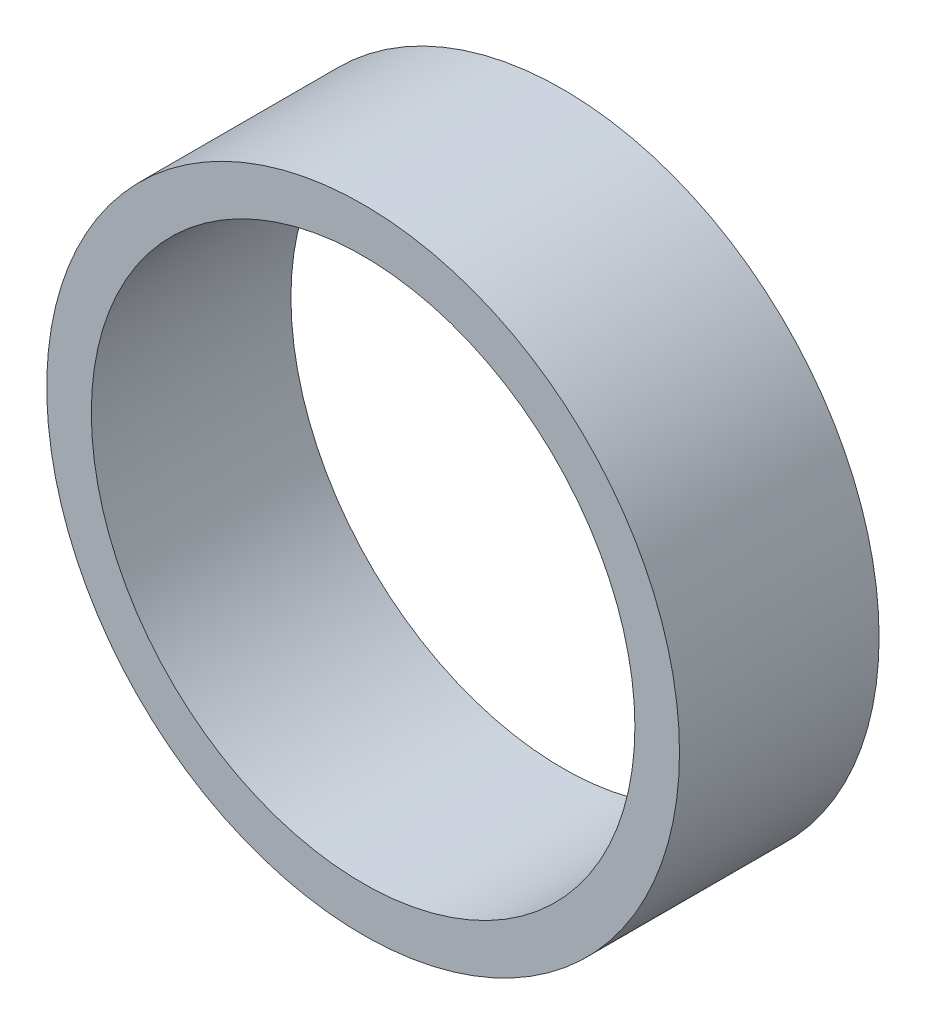
ISO-10303-21;
HEADER;
FILE_DESCRIPTION(('STEP AP214'),'2;1');
FILE_NAME('part.step','',(''),(''),'','','');
FILE_SCHEMA(('AUTOMOTIVE_DESIGN { 1 0 10303 214 1 1 1 1 }'));
ENDSEC;
DATA;
#1=APPLICATION_CONTEXT('core data for automotive mechanical design processes');
#2=APPLICATION_PROTOCOL_DEFINITION('international standard','automotive_design',2000,#1);
#3=PRODUCT_CONTEXT('',#1,'mechanical');
#4=PRODUCT('Part','Part','',(#3));
#5=PRODUCT_RELATED_PRODUCT_CATEGORY('part','',(#4));
#6=PRODUCT_DEFINITION_FORMATION('','',#4);
#7=PRODUCT_DEFINITION_CONTEXT('part definition',#1,'design');
#8=PRODUCT_DEFINITION('design','',#6,#7);
#9=PRODUCT_DEFINITION_SHAPE('','',#8);
#10=(LENGTH_UNIT() NAMED_UNIT(*) SI_UNIT(.MILLI.,.METRE.));
#11=(NAMED_UNIT(*) PLANE_ANGLE_UNIT() SI_UNIT($,.RADIAN.));
#12=(NAMED_UNIT(*) SI_UNIT($,.STERADIAN.) SOLID_ANGLE_UNIT());
#13=UNCERTAINTY_MEASURE_WITH_UNIT(LENGTH_MEASURE(1.E-05),#10,'distance_accuracy_value','');
#14=(GEOMETRIC_REPRESENTATION_CONTEXT(3) GLOBAL_UNCERTAINTY_ASSIGNED_CONTEXT((#13)) GLOBAL_UNIT_ASSIGNED_CONTEXT((#10,
#11,#12)) REPRESENTATION_CONTEXT('',''));
#15=CARTESIAN_POINT('',(0.,0.,0.));
#16=DIRECTION('',(0.,0.,1.));
#17=DIRECTION('',(1.,0.,0.));
#18=AXIS2_PLACEMENT_3D('',#15,#16,#17);
#19=CARTESIAN_POINT('',(0.,0.,4.7));
#20=DIRECTION('',(0.,0.,1.));
#21=DIRECTION('',(1.,0.,0.));
#22=AXIS2_PLACEMENT_3D('',#19,#20,#21);
#23=PLANE('',#22);
#24=CARTESIAN_POINT('',(0.,0.,4.7));
#25=DIRECTION('',(0.,0.,1.));
#26=DIRECTION('',(1.,0.,0.));
#27=AXIS2_PLACEMENT_3D('',#24,#25,#26);
#28=CIRCLE('',#27,7.45);
#29=CARTESIAN_POINT('',(7.45,0.,4.7));
#30=VERTEX_POINT('',#29);
#31=EDGE_CURVE('E10',#30,#30,#28,.T.);
#32=ORIENTED_EDGE('',*,*,#31,.T.);
#33=EDGE_LOOP('',(#32));
#34=FACE_BOUND('',#33,.T.);
#35=CARTESIAN_POINT('',(0.,0.,4.7));
#36=DIRECTION('',(0.,0.,1.));
#37=DIRECTION('',(1.,0.,0.));
#38=AXIS2_PLACEMENT_3D('',#35,#36,#37);
#39=CIRCLE('',#38,6.4);
#40=CARTESIAN_POINT('',(6.4,0.,4.7));
#41=VERTEX_POINT('',#40);
#42=EDGE_CURVE('E46',#41,#41,#39,.T.);
#43=ORIENTED_EDGE('',*,*,#42,.F.);
#44=EDGE_LOOP('',(#43));
#45=FACE_BOUND('',#44,.T.);
#46=ADVANCED_FACE('F35',(#34,#45),#23,.T.);
#47=CARTESIAN_POINT('',(0.,0.,0.));
#48=DIRECTION('',(0.,0.,1.));
#49=DIRECTION('',(1.,0.,0.));
#50=AXIS2_PLACEMENT_3D('',#47,#48,#49);
#51=PLANE('',#50);
#52=CARTESIAN_POINT('',(0.,0.,0.));
#53=DIRECTION('',(0.,0.,1.));
#54=DIRECTION('',(1.,0.,0.));
#55=AXIS2_PLACEMENT_3D('',#52,#53,#54);
#56=CIRCLE('',#55,7.45);
#57=CARTESIAN_POINT('',(7.45,0.,0.));
#58=VERTEX_POINT('',#57);
#59=EDGE_CURVE('E39',#58,#58,#56,.T.);
#60=ORIENTED_EDGE('',*,*,#59,.F.);
#61=EDGE_LOOP('',(#60));
#62=FACE_BOUND('',#61,.T.);
#63=CARTESIAN_POINT('',(0.,0.,0.));
#64=DIRECTION('',(0.,0.,1.));
#65=DIRECTION('',(1.,0.,0.));
#66=AXIS2_PLACEMENT_3D('',#63,#64,#65);
#67=CIRCLE('',#66,6.4);
#68=CARTESIAN_POINT('',(6.4,0.,0.));
#69=VERTEX_POINT('',#68);
#70=EDGE_CURVE('E48',#69,#69,#67,.T.);
#71=ORIENTED_EDGE('',*,*,#70,.T.);
#72=EDGE_LOOP('',(#71));
#73=FACE_BOUND('',#72,.T.);
#74=ADVANCED_FACE('F58',(#62,#73),#51,.F.);
#75=CARTESIAN_POINT('',(0.,0.,4.7));
#76=DIRECTION('',(0.,0.,-1.));
#77=DIRECTION('',(-1.,0.,0.));
#78=AXIS2_PLACEMENT_3D('',#75,#76,#77);
#79=CYLINDRICAL_SURFACE('',#78,7.45);
#80=ORIENTED_EDGE('',*,*,#31,.F.);
#81=EDGE_LOOP('',(#80));
#82=FACE_BOUND('',#81,.T.);
#83=ORIENTED_EDGE('',*,*,#59,.T.);
#84=EDGE_LOOP('',(#83));
#85=FACE_BOUND('',#84,.T.);
#86=ADVANCED_FACE('F37',(#82,#85),#79,.T.);
#87=CARTESIAN_POINT('',(0.,0.,4.7));
#88=DIRECTION('',(0.,0.,-1.));
#89=DIRECTION('',(-1.,0.,0.));
#90=AXIS2_PLACEMENT_3D('',#87,#88,#89);
#91=CYLINDRICAL_SURFACE('',#90,6.4);
#92=ORIENTED_EDGE('',*,*,#42,.T.);
#93=EDGE_LOOP('',(#92));
#94=FACE_BOUND('',#93,.T.);
#95=ORIENTED_EDGE('',*,*,#70,.F.);
#96=EDGE_LOOP('',(#95));
#97=FACE_BOUND('',#96,.T.);
#98=ADVANCED_FACE('F54',(#94,#97),#91,.F.);
#99=CLOSED_SHELL('',(#46,#74,#86,#98));
#100=MANIFOLD_SOLID_BREP('B2',#99);
#101=ADVANCED_BREP_SHAPE_REPRESENTATION('',(#18,#100),#14);
#102=SHAPE_DEFINITION_REPRESENTATION(#9,#101);
ENDSEC;
END-ISO-10303-21;
